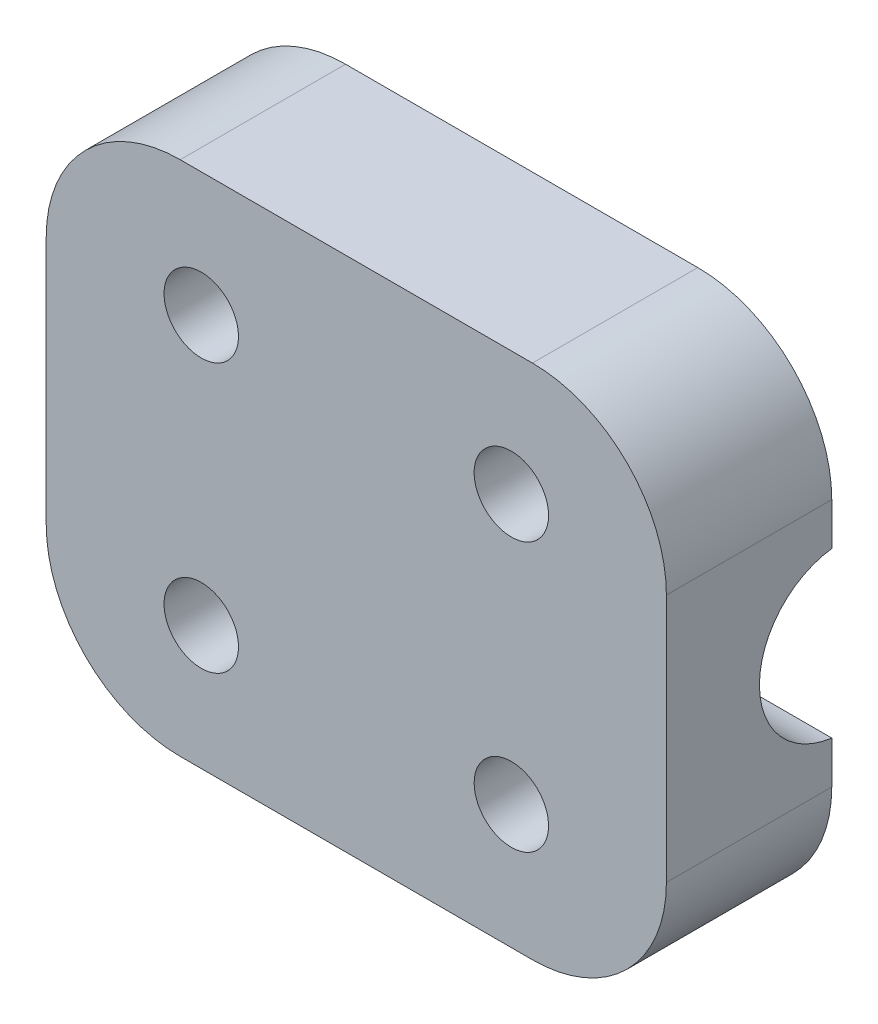
ISO-10303-21;
HEADER;
FILE_DESCRIPTION(('STEP AP214'),'2;1');
FILE_NAME('part.step','',(''),(''),'','','');
FILE_SCHEMA(('AUTOMOTIVE_DESIGN { 1 0 10303 214 1 1 1 1 }'));
ENDSEC;
DATA;
#1=APPLICATION_CONTEXT('core data for automotive mechanical design processes');
#2=APPLICATION_PROTOCOL_DEFINITION('international standard','automotive_design',2000,#1);
#3=PRODUCT_CONTEXT('',#1,'mechanical');
#4=PRODUCT('Part','Part','',(#3));
#5=PRODUCT_RELATED_PRODUCT_CATEGORY('part','',(#4));
#6=PRODUCT_DEFINITION_FORMATION('','',#4);
#7=PRODUCT_DEFINITION_CONTEXT('part definition',#1,'design');
#8=PRODUCT_DEFINITION('design','',#6,#7);
#9=PRODUCT_DEFINITION_SHAPE('','',#8);
#10=(LENGTH_UNIT() NAMED_UNIT(*) SI_UNIT(.MILLI.,.METRE.));
#11=(NAMED_UNIT(*) PLANE_ANGLE_UNIT() SI_UNIT($,.RADIAN.));
#12=(NAMED_UNIT(*) SI_UNIT($,.STERADIAN.) SOLID_ANGLE_UNIT());
#13=UNCERTAINTY_MEASURE_WITH_UNIT(LENGTH_MEASURE(1.E-05),#10,'distance_accuracy_value','');
#14=(GEOMETRIC_REPRESENTATION_CONTEXT(3) GLOBAL_UNCERTAINTY_ASSIGNED_CONTEXT((#13)) GLOBAL_UNIT_ASSIGNED_CONTEXT((#10,
#11,#12)) REPRESENTATION_CONTEXT('',''));
#15=CARTESIAN_POINT('',(0.,0.,0.));
#16=DIRECTION('',(0.,0.,1.));
#17=DIRECTION('',(1.,0.,0.));
#18=AXIS2_PLACEMENT_3D('',#15,#16,#17);
#19=CARTESIAN_POINT('',(15.,14.,-8.49999944731946));
#20=DIRECTION('',(-1.,0.,0.));
#21=DIRECTION('',(0.,0.,1.));
#22=AXIS2_PLACEMENT_3D('',#19,#20,#21);
#23=CYLINDRICAL_SURFACE('',#22,3.5);
#24=CARTESIAN_POINT('',(0.,14.,-8.49999944731946));
#25=DIRECTION('',(1.,0.,0.));
#26=DIRECTION('',(0.,0.,-1.));
#27=AXIS2_PLACEMENT_3D('',#24,#25,#26);
#28=CIRCLE('',#27,3.5);
#29=CARTESIAN_POINT('',(0.,10.5358983050897,-8.));
#30=VERTEX_POINT('',#29);
#31=CARTESIAN_POINT('',(0.,17.4641016949103,-8.));
#32=VERTEX_POINT('',#31);
#33=EDGE_CURVE('E42',#30,#32,#28,.F.);
#34=ORIENTED_EDGE('',*,*,#33,.F.);
#35=DIRECTION('',(-1.,0.,0.));
#36=VECTOR('',#35,1.);
#37=CARTESIAN_POINT('',(15.,10.5358983050897,-8.));
#38=LINE('',#37,#36);
#39=CARTESIAN_POINT('',(-15.,10.5358983050897,-8.));
#40=VERTEX_POINT('',#39);
#41=EDGE_CURVE('E201',#30,#40,#38,.T.);
#42=ORIENTED_EDGE('',*,*,#41,.T.);
#43=CARTESIAN_POINT('',(-15.,14.,-8.49999944731946));
#44=DIRECTION('',(-1.,0.,0.));
#45=DIRECTION('',(0.,0.,1.));
#46=AXIS2_PLACEMENT_3D('',#43,#44,#45);
#47=CIRCLE('',#46,3.5);
#48=CARTESIAN_POINT('',(-15.,17.4641016949103,-8.));
#49=VERTEX_POINT('',#48);
#50=EDGE_CURVE('E57',#40,#49,#47,.T.);
#51=ORIENTED_EDGE('',*,*,#50,.T.);
#52=DIRECTION('',(-1.,0.,0.));
#53=VECTOR('',#52,1.);
#54=CARTESIAN_POINT('',(15.,17.4641016949103,-8.));
#55=LINE('',#54,#53);
#56=EDGE_CURVE('E186',#49,#32,#55,.F.);
#57=ORIENTED_EDGE('',*,*,#56,.T.);
#58=EDGE_LOOP('',(#34,#42,#51,#57));
#59=FACE_BOUND('',#58,.T.);
#60=ADVANCED_FACE('F34',(#59),#23,.F.);
#61=CARTESIAN_POINT('',(-8.519238,20.019238,-8.));
#62=DIRECTION('',(0.,0.,-1.));
#63=DIRECTION('',(-1.,0.,0.));
#64=AXIS2_PLACEMENT_3D('',#61,#62,#63);
#65=PLANE('',#64);
#66=DIRECTION('',(1.,0.,0.));
#67=VECTOR('',#66,1.);
#68=CARTESIAN_POINT('',(0.,10.0313730300122,-8.));
#69=LINE('',#68,#67);
#70=CARTESIAN_POINT('',(15.,10.0313730300122,-8.));
#71=VERTEX_POINT('',#70);
#72=CARTESIAN_POINT('',(0.,10.0313730300122,-8.));
#73=VERTEX_POINT('',#72);
#74=EDGE_CURVE('E271',#71,#73,#69,.F.);
#75=ORIENTED_EDGE('',*,*,#74,.F.);
#76=DIRECTION('',(0.,1.,0.));
#77=VECTOR('',#76,1.);
#78=CARTESIAN_POINT('',(15.,7.980762,-8.));
#79=LINE('',#78,#77);
#80=CARTESIAN_POINT('',(15.,7.980762,-8.));
#81=VERTEX_POINT('',#80);
#82=EDGE_CURVE('E138',#81,#71,#79,.T.);
#83=ORIENTED_EDGE('',*,*,#82,.F.);
#84=CARTESIAN_POINT('',(8.519238,7.980762,-8.));
#85=DIRECTION('',(0.,0.,1.));
#86=DIRECTION('',(-1.,0.,0.));
#87=AXIS2_PLACEMENT_3D('',#84,#85,#86);
#88=CIRCLE('',#87,6.480762);
#89=CARTESIAN_POINT('',(8.519238,1.5,-8.));
#90=VERTEX_POINT('',#89);
#91=EDGE_CURVE('E146',#90,#81,#88,.T.);
#92=ORIENTED_EDGE('',*,*,#91,.F.);
#93=DIRECTION('',(1.,0.,0.));
#94=VECTOR('',#93,1.);
#95=CARTESIAN_POINT('',(-8.519238,1.5,-8.));
#96=LINE('',#95,#94);
#97=CARTESIAN_POINT('',(-8.519238,1.5,-8.));
#98=VERTEX_POINT('',#97);
#99=EDGE_CURVE('E149',#98,#90,#96,.T.);
#100=ORIENTED_EDGE('',*,*,#99,.F.);
#101=CARTESIAN_POINT('',(-8.519238,7.980762,-8.));
#102=DIRECTION('',(0.,0.,1.));
#103=DIRECTION('',(1.,0.,0.));
#104=AXIS2_PLACEMENT_3D('',#101,#102,#103);
#105=CIRCLE('',#104,6.480762);
#106=CARTESIAN_POINT('',(-15.,7.980762,-8.));
#107=VERTEX_POINT('',#106);
#108=EDGE_CURVE('E277',#107,#98,#105,.T.);
#109=ORIENTED_EDGE('',*,*,#108,.F.);
#110=DIRECTION('',(0.,-1.,0.));
#111=VECTOR('',#110,1.);
#112=CARTESIAN_POINT('',(-15.,20.019238,-8.));
#113=LINE('',#112,#111);
#114=EDGE_CURVE('E267',#40,#107,#113,.T.);
#115=ORIENTED_EDGE('',*,*,#114,.F.);
#116=ORIENTED_EDGE('',*,*,#41,.F.);
#117=DIRECTION('',(0.,-1.,0.));
#118=VECTOR('',#117,1.);
#119=CARTESIAN_POINT('',(0.,20.019238,-8.));
#120=LINE('',#119,#118);
#121=EDGE_CURVE('E49',#30,#73,#120,.T.);
#122=ORIENTED_EDGE('',*,*,#121,.T.);
#123=EDGE_LOOP('',(#75,#83,#92,#100,#109,#115,#116,#122));
#124=FACE_BOUND('',#123,.T.);
#125=CARTESIAN_POINT('',(-7.50000074183275,7.50000011905503,-8.));
#126=DIRECTION('',(0.,0.,1.));
#127=DIRECTION('',(1.,0.,0.));
#128=AXIS2_PLACEMENT_3D('',#125,#126,#127);
#129=CIRCLE('',#128,1.8);
#130=CARTESIAN_POINT('',(-5.70000074183275,7.50000011905503,-8.));
#131=VERTEX_POINT('',#130);
#132=EDGE_CURVE('E162',#131,#131,#129,.T.);
#133=ORIENTED_EDGE('',*,*,#132,.T.);
#134=EDGE_LOOP('',(#133));
#135=FACE_BOUND('',#134,.T.);
#136=CARTESIAN_POINT('',(7.50000074183275,7.50000011905503,-8.));
#137=DIRECTION('',(0.,0.,1.));
#138=DIRECTION('',(-1.,0.,0.));
#139=AXIS2_PLACEMENT_3D('',#136,#137,#138);
#140=CIRCLE('',#139,1.8);
#141=CARTESIAN_POINT('',(5.70000074183275,7.50000011905503,-8.));
#142=VERTEX_POINT('',#141);
#143=EDGE_CURVE('E311',#142,#142,#140,.T.);
#144=ORIENTED_EDGE('',*,*,#143,.T.);
#145=EDGE_LOOP('',(#144));
#146=FACE_BOUND('',#145,.T.);
#147=ADVANCED_FACE('F209',(#124,#135,#146),#65,.T.);
#148=CARTESIAN_POINT('',(-8.519238,20.019238,-8.));
#149=DIRECTION('',(0.,0.,1.));
#150=DIRECTION('',(1.,0.,0.));
#151=AXIS2_PLACEMENT_3D('',#148,#149,#150);
#152=CYLINDRICAL_SURFACE('',#151,6.480762);
#153=CARTESIAN_POINT('',(-8.519238,20.019238,0.));
#154=DIRECTION('',(0.,0.,1.));
#155=DIRECTION('',(-1.,0.,0.));
#156=AXIS2_PLACEMENT_3D('',#153,#154,#155);
#157=CIRCLE('',#156,6.480762);
#158=CARTESIAN_POINT('',(-8.519238,26.5,0.));
#159=VERTEX_POINT('',#158);
#160=CARTESIAN_POINT('',(-15.,20.019238,0.));
#161=VERTEX_POINT('',#160);
#162=EDGE_CURVE('E158',#159,#161,#157,.T.);
#163=ORIENTED_EDGE('',*,*,#162,.F.);
#164=DIRECTION('',(0.,0.,1.));
#165=VECTOR('',#164,1.);
#166=CARTESIAN_POINT('',(-8.519238,26.5,-8.));
#167=LINE('',#166,#165);
#168=CARTESIAN_POINT('',(-8.519238,26.5,-8.));
#169=VERTEX_POINT('',#168);
#170=EDGE_CURVE('E184',#169,#159,#167,.T.);
#171=ORIENTED_EDGE('',*,*,#170,.F.);
#172=CARTESIAN_POINT('',(-8.519238,20.019238,-8.));
#173=DIRECTION('',(0.,0.,1.));
#174=DIRECTION('',(-1.,0.,0.));
#175=AXIS2_PLACEMENT_3D('',#172,#173,#174);
#176=CIRCLE('',#175,6.480762);
#177=CARTESIAN_POINT('',(-15.,20.019238,-8.));
#178=VERTEX_POINT('',#177);
#179=EDGE_CURVE('E183',#169,#178,#176,.T.);
#180=ORIENTED_EDGE('',*,*,#179,.T.);
#181=DIRECTION('',(0.,0.,1.));
#182=VECTOR('',#181,1.);
#183=CARTESIAN_POINT('',(-15.,20.019238,-8.));
#184=LINE('',#183,#182);
#185=EDGE_CURVE('E157',#178,#161,#184,.T.);
#186=ORIENTED_EDGE('',*,*,#185,.T.);
#187=EDGE_LOOP('',(#163,#171,#180,#186));
#188=FACE_BOUND('',#187,.T.);
#189=ADVANCED_FACE('F36',(#188),#152,.T.);
#190=CARTESIAN_POINT('',(8.519238,26.5,-8.));
#191=DIRECTION('',(0.,1.,0.));
#192=DIRECTION('',(-1.,0.,0.));
#193=AXIS2_PLACEMENT_3D('',#190,#191,#192);
#194=PLANE('',#193);
#195=DIRECTION('',(-1.,0.,0.));
#196=VECTOR('',#195,1.);
#197=CARTESIAN_POINT('',(8.519238,26.5,0.));
#198=LINE('',#197,#196);
#199=CARTESIAN_POINT('',(8.519238,26.5,0.));
#200=VERTEX_POINT('',#199);
#201=EDGE_CURVE('E180',#200,#159,#198,.T.);
#202=ORIENTED_EDGE('',*,*,#201,.F.);
#203=DIRECTION('',(0.,0.,1.));
#204=VECTOR('',#203,1.);
#205=CARTESIAN_POINT('',(8.519238,26.5,-8.));
#206=LINE('',#205,#204);
#207=CARTESIAN_POINT('',(8.519238,26.5,-8.));
#208=VERTEX_POINT('',#207);
#209=EDGE_CURVE('E187',#208,#200,#206,.T.);
#210=ORIENTED_EDGE('',*,*,#209,.F.);
#211=DIRECTION('',(-1.,0.,0.));
#212=VECTOR('',#211,1.);
#213=CARTESIAN_POINT('',(8.519238,26.5,-8.));
#214=LINE('',#213,#212);
#215=EDGE_CURVE('E154',#208,#169,#214,.T.);
#216=ORIENTED_EDGE('',*,*,#215,.T.);
#217=ORIENTED_EDGE('',*,*,#170,.T.);
#218=EDGE_LOOP('',(#202,#210,#216,#217));
#219=FACE_BOUND('',#218,.T.);
#220=ADVANCED_FACE('F241',(#219),#194,.T.);
#221=CARTESIAN_POINT('',(8.519238,20.019238,-8.));
#222=DIRECTION('',(0.,0.,1.));
#223=DIRECTION('',(1.,0.,0.));
#224=AXIS2_PLACEMENT_3D('',#221,#222,#223);
#225=CYLINDRICAL_SURFACE('',#224,6.480762);
#226=CARTESIAN_POINT('',(8.519238,20.019238,0.));
#227=DIRECTION('',(0.,0.,1.));
#228=DIRECTION('',(1.,0.,0.));
#229=AXIS2_PLACEMENT_3D('',#226,#227,#228);
#230=CIRCLE('',#229,6.480762);
#231=CARTESIAN_POINT('',(15.,20.019238,0.));
#232=VERTEX_POINT('',#231);
#233=EDGE_CURVE('E177',#232,#200,#230,.T.);
#234=ORIENTED_EDGE('',*,*,#233,.F.);
#235=DIRECTION('',(0.,0.,1.));
#236=VECTOR('',#235,1.);
#237=CARTESIAN_POINT('',(15.,20.019238,-8.));
#238=LINE('',#237,#236);
#239=CARTESIAN_POINT('',(15.,20.019238,-8.));
#240=VERTEX_POINT('',#239);
#241=EDGE_CURVE('E189',#240,#232,#238,.T.);
#242=ORIENTED_EDGE('',*,*,#241,.F.);
#243=CARTESIAN_POINT('',(8.519238,20.019238,-8.));
#244=DIRECTION('',(0.,0.,1.));
#245=DIRECTION('',(1.,0.,0.));
#246=AXIS2_PLACEMENT_3D('',#243,#244,#245);
#247=CIRCLE('',#246,6.480762);
#248=EDGE_CURVE('E145',#240,#208,#247,.T.);
#249=ORIENTED_EDGE('',*,*,#248,.T.);
#250=ORIENTED_EDGE('',*,*,#209,.T.);
#251=EDGE_LOOP('',(#234,#242,#249,#250));
#252=FACE_BOUND('',#251,.T.);
#253=ADVANCED_FACE('F244',(#252),#225,.T.);
#254=CARTESIAN_POINT('',(15.,7.980762,-8.));
#255=DIRECTION('',(1.,0.,0.));
#256=DIRECTION('',(0.,0.,-1.));
#257=AXIS2_PLACEMENT_3D('',#254,#255,#256);
#258=PLANE('',#257);
#259=CARTESIAN_POINT('',(15.,14.,-8.49999997308512));
#260=DIRECTION('',(1.,0.,0.));
#261=DIRECTION('',(0.,0.,-1.));
#262=AXIS2_PLACEMENT_3D('',#259,#260,#261);
#263=CIRCLE('',#262,4.);
#264=CARTESIAN_POINT('',(15.,17.9686269699878,-8.));
#265=VERTEX_POINT('',#264);
#266=EDGE_CURVE('E126',#265,#71,#263,.T.);
#267=ORIENTED_EDGE('',*,*,#266,.F.);
#268=EDGE_CURVE('E135',#265,#240,#79,.T.);
#269=ORIENTED_EDGE('',*,*,#268,.T.);
#270=ORIENTED_EDGE('',*,*,#241,.T.);
#271=DIRECTION('',(0.,1.,0.));
#272=VECTOR('',#271,1.);
#273=CARTESIAN_POINT('',(15.,7.980762,0.));
#274=LINE('',#273,#272);
#275=CARTESIAN_POINT('',(15.,7.980762,0.));
#276=VERTEX_POINT('',#275);
#277=EDGE_CURVE('E174',#276,#232,#274,.T.);
#278=ORIENTED_EDGE('',*,*,#277,.F.);
#279=DIRECTION('',(0.,0.,1.));
#280=VECTOR('',#279,1.);
#281=CARTESIAN_POINT('',(15.,7.980762,-8.));
#282=LINE('',#281,#280);
#283=EDGE_CURVE('E191',#81,#276,#282,.T.);
#284=ORIENTED_EDGE('',*,*,#283,.F.);
#285=ORIENTED_EDGE('',*,*,#82,.T.);
#286=EDGE_LOOP('',(#267,#269,#270,#278,#284,#285));
#287=FACE_BOUND('',#286,.T.);
#288=ADVANCED_FACE('F134',(#287),#258,.T.);
#289=CARTESIAN_POINT('',(8.519238,7.980762,-8.));
#290=DIRECTION('',(0.,0.,1.));
#291=DIRECTION('',(1.,0.,0.));
#292=AXIS2_PLACEMENT_3D('',#289,#290,#291);
#293=CYLINDRICAL_SURFACE('',#292,6.480762);
#294=CARTESIAN_POINT('',(8.519238,7.980762,0.));
#295=DIRECTION('',(0.,0.,1.));
#296=DIRECTION('',(-1.,0.,0.));
#297=AXIS2_PLACEMENT_3D('',#294,#295,#296);
#298=CIRCLE('',#297,6.480762);
#299=CARTESIAN_POINT('',(8.519238,1.5,0.));
#300=VERTEX_POINT('',#299);
#301=EDGE_CURVE('E171',#300,#276,#298,.T.);
#302=ORIENTED_EDGE('',*,*,#301,.F.);
#303=DIRECTION('',(0.,0.,1.));
#304=VECTOR('',#303,1.);
#305=CARTESIAN_POINT('',(8.519238,1.5,-8.));
#306=LINE('',#305,#304);
#307=EDGE_CURVE('E193',#90,#300,#306,.T.);
#308=ORIENTED_EDGE('',*,*,#307,.F.);
#309=ORIENTED_EDGE('',*,*,#91,.T.);
#310=ORIENTED_EDGE('',*,*,#283,.T.);
#311=EDGE_LOOP('',(#302,#308,#309,#310));
#312=FACE_BOUND('',#311,.T.);
#313=ADVANCED_FACE('F251',(#312),#293,.T.);
#314=CARTESIAN_POINT('',(-8.519238,1.5,-8.));
#315=DIRECTION('',(0.,-1.,0.));
#316=DIRECTION('',(0.,0.,-1.));
#317=AXIS2_PLACEMENT_3D('',#314,#315,#316);
#318=PLANE('',#317);
#319=DIRECTION('',(1.,0.,0.));
#320=VECTOR('',#319,1.);
#321=CARTESIAN_POINT('',(-8.519238,1.5,0.));
#322=LINE('',#321,#320);
#323=CARTESIAN_POINT('',(-8.519238,1.5,0.));
#324=VERTEX_POINT('',#323);
#325=EDGE_CURVE('E168',#324,#300,#322,.T.);
#326=ORIENTED_EDGE('',*,*,#325,.F.);
#327=DIRECTION('',(0.,0.,1.));
#328=VECTOR('',#327,1.);
#329=CARTESIAN_POINT('',(-8.519238,1.5,-8.));
#330=LINE('',#329,#328);
#331=EDGE_CURVE('E195',#98,#324,#330,.T.);
#332=ORIENTED_EDGE('',*,*,#331,.F.);
#333=ORIENTED_EDGE('',*,*,#99,.T.);
#334=ORIENTED_EDGE('',*,*,#307,.T.);
#335=EDGE_LOOP('',(#326,#332,#333,#334));
#336=FACE_BOUND('',#335,.T.);
#337=ADVANCED_FACE('F254',(#336),#318,.T.);
#338=CARTESIAN_POINT('',(-8.519238,7.980762,-8.));
#339=DIRECTION('',(0.,0.,1.));
#340=DIRECTION('',(1.,0.,0.));
#341=AXIS2_PLACEMENT_3D('',#338,#339,#340);
#342=CYLINDRICAL_SURFACE('',#341,6.480762);
#343=CARTESIAN_POINT('',(-8.519238,7.980762,0.));
#344=DIRECTION('',(0.,0.,1.));
#345=DIRECTION('',(1.,0.,0.));
#346=AXIS2_PLACEMENT_3D('',#343,#344,#345);
#347=CIRCLE('',#346,6.480762);
#348=CARTESIAN_POINT('',(-15.,7.980762,0.));
#349=VERTEX_POINT('',#348);
#350=EDGE_CURVE('E165',#349,#324,#347,.T.);
#351=ORIENTED_EDGE('',*,*,#350,.F.);
#352=DIRECTION('',(0.,0.,1.));
#353=VECTOR('',#352,1.);
#354=CARTESIAN_POINT('',(-15.,7.980762,-8.));
#355=LINE('',#354,#353);
#356=EDGE_CURVE('E197',#107,#349,#355,.T.);
#357=ORIENTED_EDGE('',*,*,#356,.F.);
#358=ORIENTED_EDGE('',*,*,#108,.T.);
#359=ORIENTED_EDGE('',*,*,#331,.T.);
#360=EDGE_LOOP('',(#351,#357,#358,#359));
#361=FACE_BOUND('',#360,.T.);
#362=ADVANCED_FACE('F258',(#361),#342,.T.);
#363=CARTESIAN_POINT('',(-15.,20.019238,-8.));
#364=DIRECTION('',(-1.,0.,0.));
#365=DIRECTION('',(0.,0.,1.));
#366=AXIS2_PLACEMENT_3D('',#363,#364,#365);
#367=PLANE('',#366);
#368=ORIENTED_EDGE('',*,*,#50,.F.);
#369=ORIENTED_EDGE('',*,*,#114,.T.);
#370=ORIENTED_EDGE('',*,*,#356,.T.);
#371=DIRECTION('',(0.,-1.,0.));
#372=VECTOR('',#371,1.);
#373=CARTESIAN_POINT('',(-15.,20.019238,0.));
#374=LINE('',#373,#372);
#375=EDGE_CURVE('E161',#161,#349,#374,.T.);
#376=ORIENTED_EDGE('',*,*,#375,.F.);
#377=ORIENTED_EDGE('',*,*,#185,.F.);
#378=EDGE_CURVE('E269',#178,#49,#113,.T.);
#379=ORIENTED_EDGE('',*,*,#378,.T.);
#380=EDGE_LOOP('',(#368,#369,#370,#376,#377,#379));
#381=FACE_BOUND('',#380,.T.);
#382=ADVANCED_FACE('F237',(#381),#367,.T.);
#383=DIRECTION('',(1.,0.,0.));
#384=VECTOR('',#383,1.);
#385=CARTESIAN_POINT('',(0.,17.9686269699878,-8.));
#386=LINE('',#385,#384);
#387=CARTESIAN_POINT('',(0.,17.9686269699878,-8.));
#388=VERTEX_POINT('',#387);
#389=EDGE_CURVE('E11',#388,#265,#386,.T.);
#390=ORIENTED_EDGE('',*,*,#389,.F.);
#391=DIRECTION('',(0.,-1.,0.));
#392=VECTOR('',#391,1.);
#393=CARTESIAN_POINT('',(0.,20.019238,-8.));
#394=LINE('',#393,#392);
#395=EDGE_CURVE('E203',#388,#32,#394,.T.);
#396=ORIENTED_EDGE('',*,*,#395,.T.);
#397=ORIENTED_EDGE('',*,*,#56,.F.);
#398=ORIENTED_EDGE('',*,*,#378,.F.);
#399=ORIENTED_EDGE('',*,*,#179,.F.);
#400=ORIENTED_EDGE('',*,*,#215,.F.);
#401=ORIENTED_EDGE('',*,*,#248,.F.);
#402=ORIENTED_EDGE('',*,*,#268,.F.);
#403=EDGE_LOOP('',(#390,#396,#397,#398,#399,#400,#401,#402));
#404=FACE_BOUND('',#403,.T.);
#405=CARTESIAN_POINT('',(7.50000074183275,20.499999880945,-8.));
#406=DIRECTION('',(0.,0.,1.));
#407=DIRECTION('',(1.,0.,0.));
#408=AXIS2_PLACEMENT_3D('',#405,#406,#407);
#409=CIRCLE('',#408,1.8);
#410=CARTESIAN_POINT('',(9.30000074183275,20.499999880945,-8.));
#411=VERTEX_POINT('',#410);
#412=EDGE_CURVE('E299',#411,#411,#409,.T.);
#413=ORIENTED_EDGE('',*,*,#412,.T.);
#414=EDGE_LOOP('',(#413));
#415=FACE_BOUND('',#414,.T.);
#416=CARTESIAN_POINT('',(-7.50000074183275,20.499999880945,-8.));
#417=DIRECTION('',(0.,0.,1.));
#418=DIRECTION('',(-1.,0.,0.));
#419=AXIS2_PLACEMENT_3D('',#416,#417,#418);
#420=CIRCLE('',#419,1.8);
#421=CARTESIAN_POINT('',(-9.30000074183275,20.499999880945,-8.));
#422=VERTEX_POINT('',#421);
#423=EDGE_CURVE('E305',#422,#422,#420,.T.);
#424=ORIENTED_EDGE('',*,*,#423,.T.);
#425=EDGE_LOOP('',(#424));
#426=FACE_BOUND('',#425,.T.);
#427=ADVANCED_FACE('F141',(#404,#415,#426),#65,.T.);
#428=CARTESIAN_POINT('',(-8.519238,20.019238,0.));
#429=DIRECTION('',(0.,0.,-1.));
#430=DIRECTION('',(-1.,0.,0.));
#431=AXIS2_PLACEMENT_3D('',#428,#429,#430);
#432=PLANE('',#431);
#433=CARTESIAN_POINT('',(7.50000074183275,20.499999880945,0.));
#434=DIRECTION('',(0.,0.,1.));
#435=DIRECTION('',(1.,0.,0.));
#436=AXIS2_PLACEMENT_3D('',#433,#434,#435);
#437=CIRCLE('',#436,1.8);
#438=CARTESIAN_POINT('',(9.30000074183275,20.499999880945,0.));
#439=VERTEX_POINT('',#438);
#440=EDGE_CURVE('E270',#439,#439,#437,.T.);
#441=ORIENTED_EDGE('',*,*,#440,.F.);
#442=EDGE_LOOP('',(#441));
#443=FACE_BOUND('',#442,.T.);
#444=CARTESIAN_POINT('',(-7.50000074183275,20.499999880945,0.));
#445=DIRECTION('',(0.,0.,1.));
#446=DIRECTION('',(-1.,0.,0.));
#447=AXIS2_PLACEMENT_3D('',#444,#445,#446);
#448=CIRCLE('',#447,1.8);
#449=CARTESIAN_POINT('',(-9.30000074183275,20.499999880945,0.));
#450=VERTEX_POINT('',#449);
#451=EDGE_CURVE('E302',#450,#450,#448,.T.);
#452=ORIENTED_EDGE('',*,*,#451,.F.);
#453=EDGE_LOOP('',(#452));
#454=FACE_BOUND('',#453,.T.);
#455=CARTESIAN_POINT('',(7.50000074183275,7.50000011905503,0.));
#456=DIRECTION('',(0.,0.,1.));
#457=DIRECTION('',(-1.,0.,0.));
#458=AXIS2_PLACEMENT_3D('',#455,#456,#457);
#459=CIRCLE('',#458,1.8);
#460=CARTESIAN_POINT('',(5.70000074183275,7.50000011905503,0.));
#461=VERTEX_POINT('',#460);
#462=EDGE_CURVE('E308',#461,#461,#459,.T.);
#463=ORIENTED_EDGE('',*,*,#462,.F.);
#464=EDGE_LOOP('',(#463));
#465=FACE_BOUND('',#464,.T.);
#466=CARTESIAN_POINT('',(-7.50000074183275,7.50000011905503,0.));
#467=DIRECTION('',(0.,0.,1.));
#468=DIRECTION('',(1.,0.,0.));
#469=AXIS2_PLACEMENT_3D('',#466,#467,#468);
#470=CIRCLE('',#469,1.8);
#471=CARTESIAN_POINT('',(-5.70000074183275,7.50000011905503,0.));
#472=VERTEX_POINT('',#471);
#473=EDGE_CURVE('E314',#472,#472,#470,.T.);
#474=ORIENTED_EDGE('',*,*,#473,.F.);
#475=EDGE_LOOP('',(#474));
#476=FACE_BOUND('',#475,.T.);
#477=ORIENTED_EDGE('',*,*,#162,.T.);
#478=ORIENTED_EDGE('',*,*,#375,.T.);
#479=ORIENTED_EDGE('',*,*,#350,.T.);
#480=ORIENTED_EDGE('',*,*,#325,.T.);
#481=ORIENTED_EDGE('',*,*,#301,.T.);
#482=ORIENTED_EDGE('',*,*,#277,.T.);
#483=ORIENTED_EDGE('',*,*,#233,.T.);
#484=ORIENTED_EDGE('',*,*,#201,.T.);
#485=EDGE_LOOP('',(#477,#478,#479,#480,#481,#482,#483,#484));
#486=FACE_BOUND('',#485,.T.);
#487=ADVANCED_FACE('F233',(#443,#454,#465,#476,#486),#432,.F.);
#488=CARTESIAN_POINT('',(-7.50000074183275,7.50000011905503,-8.));
#489=DIRECTION('',(0.,0.,1.));
#490=DIRECTION('',(1.,0.,0.));
#491=AXIS2_PLACEMENT_3D('',#488,#489,#490);
#492=CYLINDRICAL_SURFACE('',#491,1.8);
#493=ORIENTED_EDGE('',*,*,#132,.F.);
#494=EDGE_LOOP('',(#493));
#495=FACE_BOUND('',#494,.T.);
#496=ORIENTED_EDGE('',*,*,#473,.T.);
#497=EDGE_LOOP('',(#496));
#498=FACE_BOUND('',#497,.T.);
#499=ADVANCED_FACE('F230',(#495,#498),#492,.F.);
#500=CARTESIAN_POINT('',(7.50000074183275,7.50000011905503,-8.));
#501=DIRECTION('',(0.,0.,1.));
#502=DIRECTION('',(1.,0.,0.));
#503=AXIS2_PLACEMENT_3D('',#500,#501,#502);
#504=CYLINDRICAL_SURFACE('',#503,1.8);
#505=ORIENTED_EDGE('',*,*,#143,.F.);
#506=EDGE_LOOP('',(#505));
#507=FACE_BOUND('',#506,.T.);
#508=ORIENTED_EDGE('',*,*,#462,.T.);
#509=EDGE_LOOP('',(#508));
#510=FACE_BOUND('',#509,.T.);
#511=ADVANCED_FACE('F226',(#507,#510),#504,.F.);
#512=CARTESIAN_POINT('',(-7.50000074183275,20.499999880945,-8.));
#513=DIRECTION('',(0.,0.,1.));
#514=DIRECTION('',(1.,0.,0.));
#515=AXIS2_PLACEMENT_3D('',#512,#513,#514);
#516=CYLINDRICAL_SURFACE('',#515,1.8);
#517=ORIENTED_EDGE('',*,*,#423,.F.);
#518=EDGE_LOOP('',(#517));
#519=FACE_BOUND('',#518,.T.);
#520=ORIENTED_EDGE('',*,*,#451,.T.);
#521=EDGE_LOOP('',(#520));
#522=FACE_BOUND('',#521,.T.);
#523=ADVANCED_FACE('F222',(#519,#522),#516,.F.);
#524=CARTESIAN_POINT('',(7.50000074183275,20.499999880945,-8.));
#525=DIRECTION('',(0.,0.,1.));
#526=DIRECTION('',(1.,0.,0.));
#527=AXIS2_PLACEMENT_3D('',#524,#525,#526);
#528=CYLINDRICAL_SURFACE('',#527,1.8);
#529=ORIENTED_EDGE('',*,*,#412,.F.);
#530=EDGE_LOOP('',(#529));
#531=FACE_BOUND('',#530,.T.);
#532=ORIENTED_EDGE('',*,*,#440,.T.);
#533=EDGE_LOOP('',(#532));
#534=FACE_BOUND('',#533,.T.);
#535=ADVANCED_FACE('F219',(#531,#534),#528,.F.);
#536=CARTESIAN_POINT('',(0.,14.,-8.49999997308512));
#537=DIRECTION('',(1.,0.,0.));
#538=DIRECTION('',(0.,0.,-1.));
#539=AXIS2_PLACEMENT_3D('',#536,#537,#538);
#540=CYLINDRICAL_SURFACE('',#539,4.);
#541=ORIENTED_EDGE('',*,*,#74,.T.);
#542=CARTESIAN_POINT('',(0.,14.,-8.49999997308512));
#543=DIRECTION('',(1.,0.,0.));
#544=DIRECTION('',(0.,0.,-1.));
#545=AXIS2_PLACEMENT_3D('',#542,#543,#544);
#546=CIRCLE('',#545,4.);
#547=EDGE_CURVE('E128',#388,#73,#546,.T.);
#548=ORIENTED_EDGE('',*,*,#547,.F.);
#549=ORIENTED_EDGE('',*,*,#389,.T.);
#550=ORIENTED_EDGE('',*,*,#266,.T.);
#551=EDGE_LOOP('',(#541,#548,#549,#550));
#552=FACE_BOUND('',#551,.T.);
#553=ADVANCED_FACE('F125',(#552),#540,.F.);
#554=CARTESIAN_POINT('',(0.,14.,-8.49999997308512));
#555=DIRECTION('',(1.,0.,0.));
#556=DIRECTION('',(0.,0.,-1.));
#557=AXIS2_PLACEMENT_3D('',#554,#555,#556);
#558=PLANE('',#557);
#559=ORIENTED_EDGE('',*,*,#33,.T.);
#560=ORIENTED_EDGE('',*,*,#395,.F.);
#561=ORIENTED_EDGE('',*,*,#547,.T.);
#562=ORIENTED_EDGE('',*,*,#121,.F.);
#563=EDGE_LOOP('',(#559,#560,#561,#562));
#564=FACE_BOUND('',#563,.T.);
#565=ADVANCED_FACE('F202',(#564),#558,.T.);
#566=CLOSED_SHELL('',(#60,#147,#189,#220,#253,#288,#313,#337,#362,#382,#427,#487,#499,#511,#523,
#535,#553,#565));
#567=MANIFOLD_SOLID_BREP('B2',#566);
#568=ADVANCED_BREP_SHAPE_REPRESENTATION('',(#18,#567),#14);
#569=SHAPE_DEFINITION_REPRESENTATION(#9,#568);
ENDSEC;
END-ISO-10303-21;
